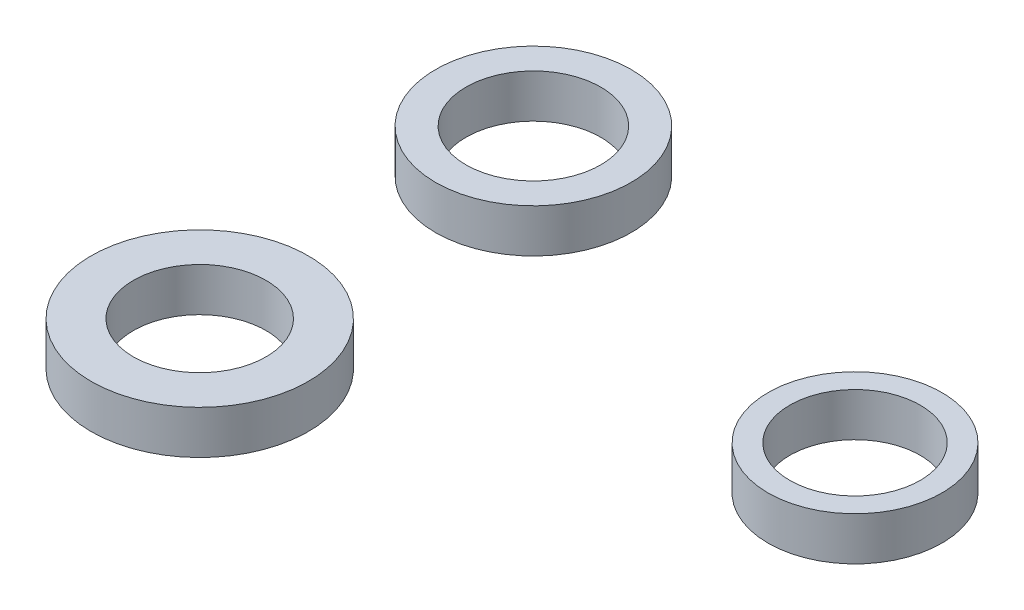
ISO-10303-21;
HEADER;
FILE_DESCRIPTION(('STEP AP214'),'2;1');
FILE_NAME('part.step','',(''),(''),'','','');
FILE_SCHEMA(('AUTOMOTIVE_DESIGN { 1 0 10303 214 1 1 1 1 }'));
ENDSEC;
DATA;
#1=APPLICATION_CONTEXT('core data for automotive mechanical design processes');
#2=APPLICATION_PROTOCOL_DEFINITION('international standard','automotive_design',2000,#1);
#3=PRODUCT_CONTEXT('',#1,'mechanical');
#4=PRODUCT('Part','Part','',(#3));
#5=PRODUCT_RELATED_PRODUCT_CATEGORY('part','',(#4));
#6=PRODUCT_DEFINITION_FORMATION('','',#4);
#7=PRODUCT_DEFINITION_CONTEXT('part definition',#1,'design');
#8=PRODUCT_DEFINITION('design','',#6,#7);
#9=PRODUCT_DEFINITION_SHAPE('','',#8);
#10=(LENGTH_UNIT() NAMED_UNIT(*) SI_UNIT(.MILLI.,.METRE.));
#11=(NAMED_UNIT(*) PLANE_ANGLE_UNIT() SI_UNIT($,.RADIAN.));
#12=(NAMED_UNIT(*) SI_UNIT($,.STERADIAN.) SOLID_ANGLE_UNIT());
#13=UNCERTAINTY_MEASURE_WITH_UNIT(LENGTH_MEASURE(1.E-05),#10,'distance_accuracy_value','');
#14=(GEOMETRIC_REPRESENTATION_CONTEXT(3) GLOBAL_UNCERTAINTY_ASSIGNED_CONTEXT((#13)) GLOBAL_UNIT_ASSIGNED_CONTEXT((#10,
#11,#12)) REPRESENTATION_CONTEXT('',''));
#15=CARTESIAN_POINT('',(0.,0.,0.));
#16=DIRECTION('',(0.,0.,1.));
#17=DIRECTION('',(1.,0.,0.));
#18=AXIS2_PLACEMENT_3D('',#15,#16,#17);
#19=CARTESIAN_POINT('',(-53.1173099936596,2.,7.28324383665756));
#20=DIRECTION('',(0.,1.,0.));
#21=DIRECTION('',(0.,0.,1.));
#22=AXIS2_PLACEMENT_3D('',#19,#20,#21);
#23=PLANE('',#22);
#24=CARTESIAN_POINT('',(-53.1173099936596,2.,7.28324383665756));
#25=DIRECTION('',(0.,1.,0.));
#26=DIRECTION('',(0.,0.,1.));
#27=AXIS2_PLACEMENT_3D('',#24,#25,#26);
#28=CIRCLE('',#27,5.);
#29=CARTESIAN_POINT('',(-53.1173099936596,2.,12.2832438366576));
#30=VERTEX_POINT('',#29);
#31=EDGE_CURVE('E11',#30,#30,#28,.T.);
#32=ORIENTED_EDGE('',*,*,#31,.T.);
#33=EDGE_LOOP('',(#32));
#34=FACE_BOUND('',#33,.T.);
#35=CARTESIAN_POINT('',(-53.1173099936596,2.,7.28324383665756));
#36=DIRECTION('',(0.,1.,0.));
#37=DIRECTION('',(0.,0.,1.));
#38=AXIS2_PLACEMENT_3D('',#35,#36,#37);
#39=CIRCLE('',#38,3.05);
#40=CARTESIAN_POINT('',(-53.1173099936596,2.,10.3332438366576));
#41=VERTEX_POINT('',#40);
#42=EDGE_CURVE('E53',#41,#41,#39,.T.);
#43=ORIENTED_EDGE('',*,*,#42,.F.);
#44=EDGE_LOOP('',(#43));
#45=FACE_BOUND('',#44,.T.);
#46=ADVANCED_FACE('F42',(#34,#45),#23,.T.);
#47=CARTESIAN_POINT('',(-53.1173099936596,0.,7.28324383665756));
#48=DIRECTION('',(0.,1.,0.));
#49=DIRECTION('',(0.,0.,1.));
#50=AXIS2_PLACEMENT_3D('',#47,#48,#49);
#51=PLANE('',#50);
#52=CARTESIAN_POINT('',(-53.1173099936596,0.,7.28324383665756));
#53=DIRECTION('',(0.,1.,0.));
#54=DIRECTION('',(0.,0.,1.));
#55=AXIS2_PLACEMENT_3D('',#52,#53,#54);
#56=CIRCLE('',#55,5.);
#57=CARTESIAN_POINT('',(-53.1173099936596,0.,12.2832438366576));
#58=VERTEX_POINT('',#57);
#59=EDGE_CURVE('E46',#58,#58,#56,.T.);
#60=ORIENTED_EDGE('',*,*,#59,.F.);
#61=EDGE_LOOP('',(#60));
#62=FACE_BOUND('',#61,.T.);
#63=CARTESIAN_POINT('',(-53.1173099936596,0.,7.28324383665756));
#64=DIRECTION('',(0.,1.,0.));
#65=DIRECTION('',(0.,0.,1.));
#66=AXIS2_PLACEMENT_3D('',#63,#64,#65);
#67=CIRCLE('',#66,3.05);
#68=CARTESIAN_POINT('',(-53.1173099936596,0.,10.3332438366576));
#69=VERTEX_POINT('',#68);
#70=EDGE_CURVE('E55',#69,#69,#67,.T.);
#71=ORIENTED_EDGE('',*,*,#70,.T.);
#72=EDGE_LOOP('',(#71));
#73=FACE_BOUND('',#72,.T.);
#74=ADVANCED_FACE('F65',(#62,#73),#51,.F.);
#75=CARTESIAN_POINT('',(-53.1173099936596,2.,7.28324383665756));
#76=DIRECTION('',(0.,-1.,0.));
#77=DIRECTION('',(0.,0.,-1.));
#78=AXIS2_PLACEMENT_3D('',#75,#76,#77);
#79=CYLINDRICAL_SURFACE('',#78,5.);
#80=ORIENTED_EDGE('',*,*,#31,.F.);
#81=EDGE_LOOP('',(#80));
#82=FACE_BOUND('',#81,.T.);
#83=ORIENTED_EDGE('',*,*,#59,.T.);
#84=EDGE_LOOP('',(#83));
#85=FACE_BOUND('',#84,.T.);
#86=ADVANCED_FACE('F44',(#82,#85),#79,.T.);
#87=CARTESIAN_POINT('',(-53.1173099936596,2.,7.28324383665756));
#88=DIRECTION('',(0.,-1.,0.));
#89=DIRECTION('',(0.,0.,-1.));
#90=AXIS2_PLACEMENT_3D('',#87,#88,#89);
#91=CYLINDRICAL_SURFACE('',#90,3.05);
#92=ORIENTED_EDGE('',*,*,#42,.T.);
#93=EDGE_LOOP('',(#92));
#94=FACE_BOUND('',#93,.T.);
#95=ORIENTED_EDGE('',*,*,#70,.F.);
#96=EDGE_LOOP('',(#95));
#97=FACE_BOUND('',#96,.T.);
#98=ADVANCED_FACE('F61',(#94,#97),#91,.F.);
#99=CLOSED_SHELL('',(#46,#74,#86,#98));
#100=MANIFOLD_SOLID_BREP('B2',#99);
#101=CARTESIAN_POINT('',(-53.1173099936596,2.,-8.06219284180416));
#102=DIRECTION('',(0.,1.,0.));
#103=DIRECTION('',(0.,0.,1.));
#104=AXIS2_PLACEMENT_3D('',#101,#102,#103);
#105=PLANE('',#104);
#106=CARTESIAN_POINT('',(-53.1173099936596,2.,-8.06219284180416));
#107=DIRECTION('',(0.,1.,0.));
#108=DIRECTION('',(0.,0.,1.));
#109=AXIS2_PLACEMENT_3D('',#106,#107,#108);
#110=CIRCLE('',#109,4.5);
#111=CARTESIAN_POINT('',(-53.1173099936596,2.,-3.56219284180417));
#112=VERTEX_POINT('',#111);
#113=EDGE_CURVE('E41',#112,#112,#110,.T.);
#114=ORIENTED_EDGE('',*,*,#113,.T.);
#115=EDGE_LOOP('',(#114));
#116=FACE_BOUND('',#115,.T.);
#117=CARTESIAN_POINT('',(-53.1173099936596,2.,-8.06219284180416));
#118=DIRECTION('',(0.,1.,0.));
#119=DIRECTION('',(0.,0.,1.));
#120=AXIS2_PLACEMENT_3D('',#117,#118,#119);
#121=CIRCLE('',#120,3.1);
#122=CARTESIAN_POINT('',(-53.1173099936596,2.,-4.96219284180417));
#123=VERTEX_POINT('',#122);
#124=EDGE_CURVE('E122',#123,#123,#121,.T.);
#125=ORIENTED_EDGE('',*,*,#124,.F.);
#126=EDGE_LOOP('',(#125));
#127=FACE_BOUND('',#126,.T.);
#128=ADVANCED_FACE('F111',(#116,#127),#105,.T.);
#129=CARTESIAN_POINT('',(-53.1173099936596,0.,-8.06219284180416));
#130=DIRECTION('',(0.,1.,0.));
#131=DIRECTION('',(0.,0.,1.));
#132=AXIS2_PLACEMENT_3D('',#129,#130,#131);
#133=PLANE('',#132);
#134=CARTESIAN_POINT('',(-53.1173099936596,0.,-8.06219284180416));
#135=DIRECTION('',(0.,1.,0.));
#136=DIRECTION('',(0.,0.,1.));
#137=AXIS2_PLACEMENT_3D('',#134,#135,#136);
#138=CIRCLE('',#137,4.5);
#139=CARTESIAN_POINT('',(-53.1173099936596,0.,-3.56219284180417));
#140=VERTEX_POINT('',#139);
#141=EDGE_CURVE('E115',#140,#140,#138,.T.);
#142=ORIENTED_EDGE('',*,*,#141,.F.);
#143=EDGE_LOOP('',(#142));
#144=FACE_BOUND('',#143,.T.);
#145=CARTESIAN_POINT('',(-53.1173099936596,0.,-8.06219284180416));
#146=DIRECTION('',(0.,1.,0.));
#147=DIRECTION('',(0.,0.,1.));
#148=AXIS2_PLACEMENT_3D('',#145,#146,#147);
#149=CIRCLE('',#148,3.1);
#150=CARTESIAN_POINT('',(-53.1173099936596,0.,-4.96219284180417));
#151=VERTEX_POINT('',#150);
#152=EDGE_CURVE('E124',#151,#151,#149,.T.);
#153=ORIENTED_EDGE('',*,*,#152,.T.);
#154=EDGE_LOOP('',(#153));
#155=FACE_BOUND('',#154,.T.);
#156=ADVANCED_FACE('F134',(#144,#155),#133,.F.);
#157=CARTESIAN_POINT('',(-53.1173099936596,2.,-8.06219284180416));
#158=DIRECTION('',(0.,-1.,0.));
#159=DIRECTION('',(0.,0.,-1.));
#160=AXIS2_PLACEMENT_3D('',#157,#158,#159);
#161=CYLINDRICAL_SURFACE('',#160,4.5);
#162=ORIENTED_EDGE('',*,*,#113,.F.);
#163=EDGE_LOOP('',(#162));
#164=FACE_BOUND('',#163,.T.);
#165=ORIENTED_EDGE('',*,*,#141,.T.);
#166=EDGE_LOOP('',(#165));
#167=FACE_BOUND('',#166,.T.);
#168=ADVANCED_FACE('F113',(#164,#167),#161,.T.);
#169=CARTESIAN_POINT('',(-53.1173099936596,2.,-8.06219284180416));
#170=DIRECTION('',(0.,-1.,0.));
#171=DIRECTION('',(0.,0.,-1.));
#172=AXIS2_PLACEMENT_3D('',#169,#170,#171);
#173=CYLINDRICAL_SURFACE('',#172,3.1);
#174=ORIENTED_EDGE('',*,*,#124,.T.);
#175=EDGE_LOOP('',(#174));
#176=FACE_BOUND('',#175,.T.);
#177=ORIENTED_EDGE('',*,*,#152,.F.);
#178=EDGE_LOOP('',(#177));
#179=FACE_BOUND('',#178,.T.);
#180=ADVANCED_FACE('F130',(#176,#179),#173,.F.);
#181=CLOSED_SHELL('',(#128,#156,#168,#180));
#182=MANIFOLD_SOLID_BREP('B6',#181);
#183=CARTESIAN_POINT('',(-33.1030912592475,2.,-2.84069057862277));
#184=DIRECTION('',(0.,1.,0.));
#185=DIRECTION('',(0.,0.,1.));
#186=AXIS2_PLACEMENT_3D('',#183,#184,#185);
#187=PLANE('',#186);
#188=CARTESIAN_POINT('',(-33.1030912592475,2.,-2.84069057862277));
#189=DIRECTION('',(0.,1.,0.));
#190=DIRECTION('',(0.,0.,1.));
#191=AXIS2_PLACEMENT_3D('',#188,#189,#190);
#192=CIRCLE('',#191,4.);
#193=CARTESIAN_POINT('',(-33.1030912592475,2.,1.15930942137722));
#194=VERTEX_POINT('',#193);
#195=EDGE_CURVE('E110',#194,#194,#192,.T.);
#196=ORIENTED_EDGE('',*,*,#195,.T.);
#197=EDGE_LOOP('',(#196));
#198=FACE_BOUND('',#197,.T.);
#199=CARTESIAN_POINT('',(-33.1030912592475,2.,-2.84069057862277));
#200=DIRECTION('',(0.,1.,0.));
#201=DIRECTION('',(0.,0.,1.));
#202=AXIS2_PLACEMENT_3D('',#199,#200,#201);
#203=CIRCLE('',#202,3.);
#204=CARTESIAN_POINT('',(-33.1030912592475,2.,0.159309421377226));
#205=VERTEX_POINT('',#204);
#206=EDGE_CURVE('E184',#205,#205,#203,.T.);
#207=ORIENTED_EDGE('',*,*,#206,.F.);
#208=EDGE_LOOP('',(#207));
#209=FACE_BOUND('',#208,.T.);
#210=ADVANCED_FACE('F173',(#198,#209),#187,.T.);
#211=CARTESIAN_POINT('',(-33.1030912592475,0.,-2.84069057862277));
#212=DIRECTION('',(0.,1.,0.));
#213=DIRECTION('',(0.,0.,1.));
#214=AXIS2_PLACEMENT_3D('',#211,#212,#213);
#215=PLANE('',#214);
#216=CARTESIAN_POINT('',(-33.1030912592475,0.,-2.84069057862277));
#217=DIRECTION('',(0.,1.,0.));
#218=DIRECTION('',(0.,0.,1.));
#219=AXIS2_PLACEMENT_3D('',#216,#217,#218);
#220=CIRCLE('',#219,4.);
#221=CARTESIAN_POINT('',(-33.1030912592475,0.,1.15930942137722));
#222=VERTEX_POINT('',#221);
#223=EDGE_CURVE('E177',#222,#222,#220,.T.);
#224=ORIENTED_EDGE('',*,*,#223,.F.);
#225=EDGE_LOOP('',(#224));
#226=FACE_BOUND('',#225,.T.);
#227=CARTESIAN_POINT('',(-33.1030912592475,0.,-2.84069057862277));
#228=DIRECTION('',(0.,1.,0.));
#229=DIRECTION('',(0.,0.,1.));
#230=AXIS2_PLACEMENT_3D('',#227,#228,#229);
#231=CIRCLE('',#230,3.);
#232=CARTESIAN_POINT('',(-33.1030912592475,0.,0.159309421377226));
#233=VERTEX_POINT('',#232);
#234=EDGE_CURVE('E186',#233,#233,#231,.T.);
#235=ORIENTED_EDGE('',*,*,#234,.T.);
#236=EDGE_LOOP('',(#235));
#237=FACE_BOUND('',#236,.T.);
#238=ADVANCED_FACE('F196',(#226,#237),#215,.F.);
#239=CARTESIAN_POINT('',(-33.1030912592475,2.,-2.84069057862277));
#240=DIRECTION('',(0.,-1.,0.));
#241=DIRECTION('',(0.,0.,-1.));
#242=AXIS2_PLACEMENT_3D('',#239,#240,#241);
#243=CYLINDRICAL_SURFACE('',#242,4.);
#244=ORIENTED_EDGE('',*,*,#195,.F.);
#245=EDGE_LOOP('',(#244));
#246=FACE_BOUND('',#245,.T.);
#247=ORIENTED_EDGE('',*,*,#223,.T.);
#248=EDGE_LOOP('',(#247));
#249=FACE_BOUND('',#248,.T.);
#250=ADVANCED_FACE('F175',(#246,#249),#243,.T.);
#251=CARTESIAN_POINT('',(-33.1030912592475,2.,-2.84069057862277));
#252=DIRECTION('',(0.,-1.,0.));
#253=DIRECTION('',(0.,0.,-1.));
#254=AXIS2_PLACEMENT_3D('',#251,#252,#253);
#255=CYLINDRICAL_SURFACE('',#254,3.);
#256=ORIENTED_EDGE('',*,*,#206,.T.);
#257=EDGE_LOOP('',(#256));
#258=FACE_BOUND('',#257,.T.);
#259=ORIENTED_EDGE('',*,*,#234,.F.);
#260=EDGE_LOOP('',(#259));
#261=FACE_BOUND('',#260,.T.);
#262=ADVANCED_FACE('F192',(#258,#261),#255,.F.);
#263=CLOSED_SHELL('',(#210,#238,#250,#262));
#264=MANIFOLD_SOLID_BREP('B36',#263);
#265=ADVANCED_BREP_SHAPE_REPRESENTATION('',(#18,#100,#182,#264),#14);
#266=SHAPE_DEFINITION_REPRESENTATION(#9,#265);
ENDSEC;
END-ISO-10303-21;
